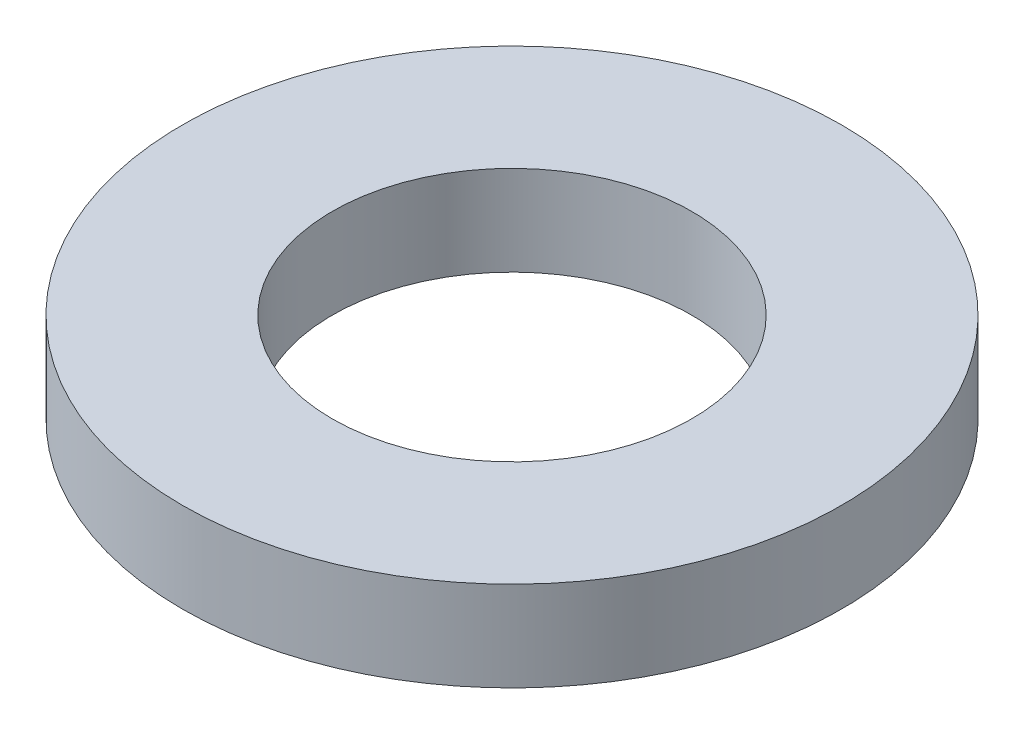
ISO-10303-21;
HEADER;
FILE_DESCRIPTION(('STEP AP214'),'2;1');
FILE_NAME('part.step','',(''),(''),'','','');
FILE_SCHEMA(('AUTOMOTIVE_DESIGN { 1 0 10303 214 1 1 1 1 }'));
ENDSEC;
DATA;
#1=APPLICATION_CONTEXT('core data for automotive mechanical design processes');
#2=APPLICATION_PROTOCOL_DEFINITION('international standard','automotive_design',2000,#1);
#3=PRODUCT_CONTEXT('',#1,'mechanical');
#4=PRODUCT('Part','Part','',(#3));
#5=PRODUCT_RELATED_PRODUCT_CATEGORY('part','',(#4));
#6=PRODUCT_DEFINITION_FORMATION('','',#4);
#7=PRODUCT_DEFINITION_CONTEXT('part definition',#1,'design');
#8=PRODUCT_DEFINITION('design','',#6,#7);
#9=PRODUCT_DEFINITION_SHAPE('','',#8);
#10=(LENGTH_UNIT() NAMED_UNIT(*) SI_UNIT(.MILLI.,.METRE.));
#11=(NAMED_UNIT(*) PLANE_ANGLE_UNIT() SI_UNIT($,.RADIAN.));
#12=(NAMED_UNIT(*) SI_UNIT($,.STERADIAN.) SOLID_ANGLE_UNIT());
#13=UNCERTAINTY_MEASURE_WITH_UNIT(LENGTH_MEASURE(1.E-05),#10,'distance_accuracy_value','');
#14=(GEOMETRIC_REPRESENTATION_CONTEXT(3) GLOBAL_UNCERTAINTY_ASSIGNED_CONTEXT((#13)) GLOBAL_UNIT_ASSIGNED_CONTEXT((#10,
#11,#12)) REPRESENTATION_CONTEXT('',''));
#15=CARTESIAN_POINT('',(0.,0.,0.));
#16=DIRECTION('',(0.,0.,1.));
#17=DIRECTION('',(1.,0.,0.));
#18=AXIS2_PLACEMENT_3D('',#15,#16,#17);
#19=CARTESIAN_POINT('',(0.,3.,0.));
#20=DIRECTION('',(0.,1.,0.));
#21=DIRECTION('',(0.,0.,1.));
#22=AXIS2_PLACEMENT_3D('',#19,#20,#21);
#23=PLANE('',#22);
#24=CARTESIAN_POINT('',(0.,3.,0.));
#25=DIRECTION('',(0.,1.,0.));
#26=DIRECTION('',(0.,0.,1.));
#27=AXIS2_PLACEMENT_3D('',#24,#25,#26);
#28=CIRCLE('',#27,11.);
#29=CARTESIAN_POINT('',(0.,3.,11.));
#30=VERTEX_POINT('',#29);
#31=EDGE_CURVE('E10',#30,#30,#28,.T.);
#32=ORIENTED_EDGE('',*,*,#31,.T.);
#33=EDGE_LOOP('',(#32));
#34=FACE_BOUND('',#33,.T.);
#35=CARTESIAN_POINT('',(0.,3.,0.));
#36=DIRECTION('',(0.,1.,0.));
#37=DIRECTION('',(0.,0.,1.));
#38=AXIS2_PLACEMENT_3D('',#35,#36,#37);
#39=CIRCLE('',#38,6.);
#40=CARTESIAN_POINT('',(0.,3.,6.));
#41=VERTEX_POINT('',#40);
#42=EDGE_CURVE('E43',#41,#41,#39,.T.);
#43=ORIENTED_EDGE('',*,*,#42,.F.);
#44=EDGE_LOOP('',(#43));
#45=FACE_BOUND('',#44,.T.);
#46=ADVANCED_FACE('F32',(#34,#45),#23,.T.);
#47=CARTESIAN_POINT('',(0.,0.,0.));
#48=DIRECTION('',(0.,1.,0.));
#49=DIRECTION('',(0.,0.,1.));
#50=AXIS2_PLACEMENT_3D('',#47,#48,#49);
#51=PLANE('',#50);
#52=CARTESIAN_POINT('',(0.,0.,0.));
#53=DIRECTION('',(0.,1.,0.));
#54=DIRECTION('',(0.,0.,1.));
#55=AXIS2_PLACEMENT_3D('',#52,#53,#54);
#56=CIRCLE('',#55,11.);
#57=CARTESIAN_POINT('',(0.,0.,11.));
#58=VERTEX_POINT('',#57);
#59=EDGE_CURVE('E36',#58,#58,#56,.T.);
#60=ORIENTED_EDGE('',*,*,#59,.F.);
#61=EDGE_LOOP('',(#60));
#62=FACE_BOUND('',#61,.T.);
#63=CARTESIAN_POINT('',(0.,0.,0.));
#64=DIRECTION('',(0.,1.,0.));
#65=DIRECTION('',(0.,0.,1.));
#66=AXIS2_PLACEMENT_3D('',#63,#64,#65);
#67=CIRCLE('',#66,6.);
#68=CARTESIAN_POINT('',(0.,0.,6.));
#69=VERTEX_POINT('',#68);
#70=EDGE_CURVE('E45',#69,#69,#67,.T.);
#71=ORIENTED_EDGE('',*,*,#70,.T.);
#72=EDGE_LOOP('',(#71));
#73=FACE_BOUND('',#72,.T.);
#74=ADVANCED_FACE('F55',(#62,#73),#51,.F.);
#75=CARTESIAN_POINT('',(0.,3.,0.));
#76=DIRECTION('',(0.,-1.,0.));
#77=DIRECTION('',(0.,0.,-1.));
#78=AXIS2_PLACEMENT_3D('',#75,#76,#77);
#79=CYLINDRICAL_SURFACE('',#78,11.);
#80=ORIENTED_EDGE('',*,*,#31,.F.);
#81=EDGE_LOOP('',(#80));
#82=FACE_BOUND('',#81,.T.);
#83=ORIENTED_EDGE('',*,*,#59,.T.);
#84=EDGE_LOOP('',(#83));
#85=FACE_BOUND('',#84,.T.);
#86=ADVANCED_FACE('F34',(#82,#85),#79,.T.);
#87=CARTESIAN_POINT('',(0.,3.,0.));
#88=DIRECTION('',(0.,-1.,0.));
#89=DIRECTION('',(0.,0.,-1.));
#90=AXIS2_PLACEMENT_3D('',#87,#88,#89);
#91=CYLINDRICAL_SURFACE('',#90,6.);
#92=ORIENTED_EDGE('',*,*,#42,.T.);
#93=EDGE_LOOP('',(#92));
#94=FACE_BOUND('',#93,.T.);
#95=ORIENTED_EDGE('',*,*,#70,.F.);
#96=EDGE_LOOP('',(#95));
#97=FACE_BOUND('',#96,.T.);
#98=ADVANCED_FACE('F51',(#94,#97),#91,.F.);
#99=CLOSED_SHELL('',(#46,#74,#86,#98));
#100=MANIFOLD_SOLID_BREP('B2',#99);
#101=ADVANCED_BREP_SHAPE_REPRESENTATION('',(#18,#100),#14);
#102=SHAPE_DEFINITION_REPRESENTATION(#9,#101);
ENDSEC;
END-ISO-10303-21;
